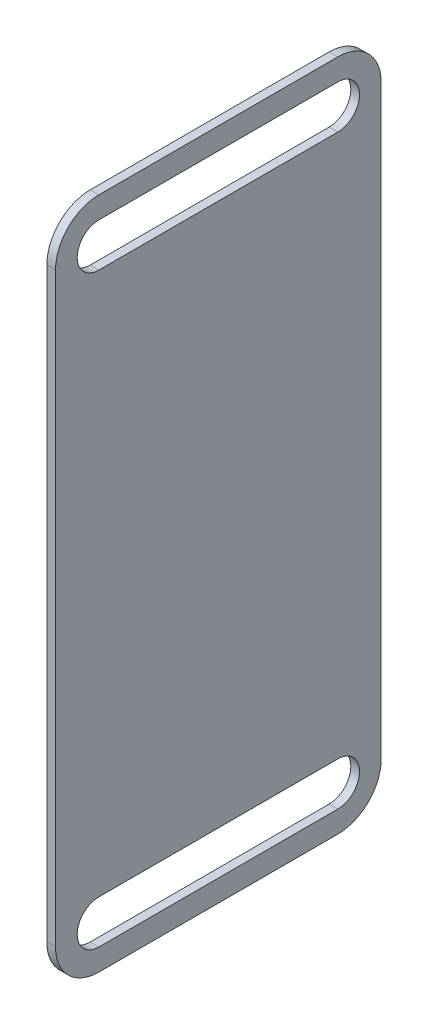
ISO-10303-21;
HEADER;
FILE_DESCRIPTION(('STEP AP214'),'2;1');
FILE_NAME('part.step','',(''),(''),'','','');
FILE_SCHEMA(('AUTOMOTIVE_DESIGN { 1 0 10303 214 1 1 1 1 }'));
ENDSEC;
DATA;
#1=APPLICATION_CONTEXT('core data for automotive mechanical design processes');
#2=APPLICATION_PROTOCOL_DEFINITION('international standard','automotive_design',2000,#1);
#3=PRODUCT_CONTEXT('',#1,'mechanical');
#4=PRODUCT('Part','Part','',(#3));
#5=PRODUCT_RELATED_PRODUCT_CATEGORY('part','',(#4));
#6=PRODUCT_DEFINITION_FORMATION('','',#4);
#7=PRODUCT_DEFINITION_CONTEXT('part definition',#1,'design');
#8=PRODUCT_DEFINITION('design','',#6,#7);
#9=PRODUCT_DEFINITION_SHAPE('','',#8);
#10=(LENGTH_UNIT() NAMED_UNIT(*) SI_UNIT(.MILLI.,.METRE.));
#11=(NAMED_UNIT(*) PLANE_ANGLE_UNIT() SI_UNIT($,.RADIAN.));
#12=(NAMED_UNIT(*) SI_UNIT($,.STERADIAN.) SOLID_ANGLE_UNIT());
#13=UNCERTAINTY_MEASURE_WITH_UNIT(LENGTH_MEASURE(1.E-05),#10,'distance_accuracy_value','');
#14=(GEOMETRIC_REPRESENTATION_CONTEXT(3) GLOBAL_UNCERTAINTY_ASSIGNED_CONTEXT((#13)) GLOBAL_UNIT_ASSIGNED_CONTEXT((#10,
#11,#12)) REPRESENTATION_CONTEXT('',''));
#15=CARTESIAN_POINT('',(0.,0.,0.));
#16=DIRECTION('',(0.,0.,1.));
#17=DIRECTION('',(1.,0.,0.));
#18=AXIS2_PLACEMENT_3D('',#15,#16,#17);
#19=CARTESIAN_POINT('',(2.54,12.7,-12.7));
#20=DIRECTION('',(-1.,0.,0.));
#21=DIRECTION('',(0.,0.,1.));
#22=AXIS2_PLACEMENT_3D('',#19,#20,#21);
#23=PLANE('',#22);
#24=CARTESIAN_POINT('',(2.54,12.7,-82.55));
#25=DIRECTION('',(1.,0.,0.));
#26=DIRECTION('',(0.,0.,-1.));
#27=AXIS2_PLACEMENT_3D('',#24,#25,#26);
#28=CIRCLE('',#27,6.35);
#29=CARTESIAN_POINT('',(2.54,6.35,-82.55));
#30=VERTEX_POINT('',#29);
#31=CARTESIAN_POINT('',(2.54,19.05,-82.55));
#32=VERTEX_POINT('',#31);
#33=EDGE_CURVE('E183',#30,#32,#28,.T.);
#34=ORIENTED_EDGE('',*,*,#33,.F.);
#35=DIRECTION('',(0.,0.,-1.));
#36=VECTOR('',#35,1.);
#37=CARTESIAN_POINT('',(2.54,6.35,-82.55));
#38=LINE('',#37,#36);
#39=CARTESIAN_POINT('',(2.54,6.34999999999999,-12.7));
#40=VERTEX_POINT('',#39);
#41=EDGE_CURVE('E191',#40,#30,#38,.T.);
#42=ORIENTED_EDGE('',*,*,#41,.F.);
#43=CARTESIAN_POINT('',(2.54,12.7,-12.7));
#44=DIRECTION('',(1.,0.,0.));
#45=DIRECTION('',(0.,0.,-1.));
#46=AXIS2_PLACEMENT_3D('',#43,#44,#45);
#47=CIRCLE('',#46,6.35);
#48=CARTESIAN_POINT('',(2.54,19.05,-12.7));
#49=VERTEX_POINT('',#48);
#50=EDGE_CURVE('E188',#49,#40,#47,.T.);
#51=ORIENTED_EDGE('',*,*,#50,.F.);
#52=DIRECTION('',(0.,0.,1.));
#53=VECTOR('',#52,1.);
#54=CARTESIAN_POINT('',(2.54,19.05,-82.55));
#55=LINE('',#54,#53);
#56=EDGE_CURVE('E185',#32,#49,#55,.T.);
#57=ORIENTED_EDGE('',*,*,#56,.F.);
#58=EDGE_LOOP('',(#34,#42,#51,#57));
#59=FACE_BOUND('',#58,.T.);
#60=CARTESIAN_POINT('',(2.54,12.7,-12.7));
#61=DIRECTION('',(1.,0.,0.));
#62=DIRECTION('',(0.,0.,1.));
#63=AXIS2_PLACEMENT_3D('',#60,#61,#62);
#64=CIRCLE('',#63,12.7);
#65=CARTESIAN_POINT('',(2.54,12.7000000000001,0.));
#66=VERTEX_POINT('',#65);
#67=CARTESIAN_POINT('',(2.54,0.,-12.7000000000001));
#68=VERTEX_POINT('',#67);
#69=EDGE_CURVE('E214',#66,#68,#64,.T.);
#70=ORIENTED_EDGE('',*,*,#69,.T.);
#71=DIRECTION('',(0.,0.,-1.));
#72=VECTOR('',#71,1.);
#73=CARTESIAN_POINT('',(2.54,0.,-12.7000000000001));
#74=LINE('',#73,#72);
#75=CARTESIAN_POINT('',(2.54,0.,-82.5499999999999));
#76=VERTEX_POINT('',#75);
#77=EDGE_CURVE('E217',#68,#76,#74,.T.);
#78=ORIENTED_EDGE('',*,*,#77,.T.);
#79=CARTESIAN_POINT('',(2.54,12.7,-82.55));
#80=DIRECTION('',(1.,0.,0.));
#81=DIRECTION('',(0.,0.,-1.));
#82=AXIS2_PLACEMENT_3D('',#79,#80,#81);
#83=CIRCLE('',#82,12.7);
#84=CARTESIAN_POINT('',(2.54,12.7,-95.25));
#85=VERTEX_POINT('',#84);
#86=EDGE_CURVE('E220',#76,#85,#83,.T.);
#87=ORIENTED_EDGE('',*,*,#86,.T.);
#88=DIRECTION('',(0.,1.,0.));
#89=VECTOR('',#88,1.);
#90=CARTESIAN_POINT('',(2.54,12.7000000000001,-95.25));
#91=LINE('',#90,#89);
#92=CARTESIAN_POINT('',(2.54,184.15,-95.25));
#93=VERTEX_POINT('',#92);
#94=EDGE_CURVE('E222',#85,#93,#91,.T.);
#95=ORIENTED_EDGE('',*,*,#94,.T.);
#96=CARTESIAN_POINT('',(2.54,184.15,-82.55));
#97=DIRECTION('',(1.,0.,0.));
#98=DIRECTION('',(0.,0.,1.));
#99=AXIS2_PLACEMENT_3D('',#96,#97,#98);
#100=CIRCLE('',#99,12.7);
#101=CARTESIAN_POINT('',(2.54,196.85,-82.5499999999999));
#102=VERTEX_POINT('',#101);
#103=EDGE_CURVE('E224',#93,#102,#100,.T.);
#104=ORIENTED_EDGE('',*,*,#103,.T.);
#105=DIRECTION('',(0.,0.,1.));
#106=VECTOR('',#105,1.);
#107=CARTESIAN_POINT('',(2.54,196.85,-12.7000000000001));
#108=LINE('',#107,#106);
#109=CARTESIAN_POINT('',(2.54,196.85,-12.7000000000001));
#110=VERTEX_POINT('',#109);
#111=EDGE_CURVE('E226',#102,#110,#108,.T.);
#112=ORIENTED_EDGE('',*,*,#111,.T.);
#113=CARTESIAN_POINT('',(2.54,184.15,-12.7));
#114=DIRECTION('',(1.,0.,0.));
#115=DIRECTION('',(0.,0.,1.));
#116=AXIS2_PLACEMENT_3D('',#113,#114,#115);
#117=CIRCLE('',#116,12.7);
#118=CARTESIAN_POINT('',(2.54,184.15,0.));
#119=VERTEX_POINT('',#118);
#120=EDGE_CURVE('E228',#110,#119,#117,.T.);
#121=ORIENTED_EDGE('',*,*,#120,.T.);
#122=DIRECTION('',(0.,-1.,0.));
#123=VECTOR('',#122,1.);
#124=CARTESIAN_POINT('',(2.54,12.7000000000001,0.));
#125=LINE('',#124,#123);
#126=EDGE_CURVE('E230',#119,#66,#125,.T.);
#127=ORIENTED_EDGE('',*,*,#126,.T.);
#128=EDGE_LOOP('',(#70,#78,#87,#95,#104,#112,#121,#127));
#129=FACE_BOUND('',#128,.T.);
#130=CARTESIAN_POINT('',(2.54,184.15,-82.55));
#131=DIRECTION('',(1.,0.,0.));
#132=DIRECTION('',(0.,0.,-1.));
#133=AXIS2_PLACEMENT_3D('',#130,#131,#132);
#134=CIRCLE('',#133,6.35000000000005);
#135=CARTESIAN_POINT('',(2.54,177.8,-82.55));
#136=VERTEX_POINT('',#135);
#137=CARTESIAN_POINT('',(2.54,190.5,-82.55));
#138=VERTEX_POINT('',#137);
#139=EDGE_CURVE('E147',#136,#138,#134,.T.);
#140=ORIENTED_EDGE('',*,*,#139,.F.);
#141=DIRECTION('',(0.,0.,-1.));
#142=VECTOR('',#141,1.);
#143=CARTESIAN_POINT('',(2.54,177.8,-82.55));
#144=LINE('',#143,#142);
#145=CARTESIAN_POINT('',(2.54,177.8,-12.7));
#146=VERTEX_POINT('',#145);
#147=EDGE_CURVE('E169',#146,#136,#144,.T.);
#148=ORIENTED_EDGE('',*,*,#147,.F.);
#149=CARTESIAN_POINT('',(2.54,184.15,-12.7));
#150=DIRECTION('',(1.,0.,0.));
#151=DIRECTION('',(0.,0.,-1.));
#152=AXIS2_PLACEMENT_3D('',#149,#150,#151);
#153=CIRCLE('',#152,6.35000000000001);
#154=CARTESIAN_POINT('',(2.54,190.5,-12.7));
#155=VERTEX_POINT('',#154);
#156=EDGE_CURVE('E167',#155,#146,#153,.T.);
#157=ORIENTED_EDGE('',*,*,#156,.F.);
#158=DIRECTION('',(0.,0.,1.));
#159=VECTOR('',#158,1.);
#160=CARTESIAN_POINT('',(2.54,190.5,-82.55));
#161=LINE('',#160,#159);
#162=EDGE_CURVE('E155',#138,#155,#161,.T.);
#163=ORIENTED_EDGE('',*,*,#162,.F.);
#164=EDGE_LOOP('',(#140,#148,#157,#163));
#165=FACE_BOUND('',#164,.T.);
#166=ADVANCED_FACE('F34',(#59,#129,#165),#23,.F.);
#167=CARTESIAN_POINT('',(0.,12.7,-12.7));
#168=DIRECTION('',(-1.,0.,0.));
#169=DIRECTION('',(0.,0.,1.));
#170=AXIS2_PLACEMENT_3D('',#167,#168,#169);
#171=PLANE('',#170);
#172=CARTESIAN_POINT('',(0.,12.7,-12.7));
#173=DIRECTION('',(1.,0.,0.));
#174=DIRECTION('',(0.,0.,1.));
#175=AXIS2_PLACEMENT_3D('',#172,#173,#174);
#176=CIRCLE('',#175,12.7);
#177=CARTESIAN_POINT('',(0.,12.7000000000001,0.));
#178=VERTEX_POINT('',#177);
#179=CARTESIAN_POINT('',(0.,0.,-12.7000000000001));
#180=VERTEX_POINT('',#179);
#181=EDGE_CURVE('E213',#178,#180,#176,.T.);
#182=ORIENTED_EDGE('',*,*,#181,.F.);
#183=DIRECTION('',(0.,-1.,0.));
#184=VECTOR('',#183,1.);
#185=CARTESIAN_POINT('',(0.,12.7000000000001,0.));
#186=LINE('',#185,#184);
#187=CARTESIAN_POINT('',(0.,184.15,0.));
#188=VERTEX_POINT('',#187);
#189=EDGE_CURVE('E218',#188,#178,#186,.T.);
#190=ORIENTED_EDGE('',*,*,#189,.F.);
#191=CARTESIAN_POINT('',(0.,184.15,-12.7));
#192=DIRECTION('',(1.,0.,0.));
#193=DIRECTION('',(0.,0.,1.));
#194=AXIS2_PLACEMENT_3D('',#191,#192,#193);
#195=CIRCLE('',#194,12.7);
#196=CARTESIAN_POINT('',(0.,196.85,-12.7000000000001));
#197=VERTEX_POINT('',#196);
#198=EDGE_CURVE('E245',#197,#188,#195,.T.);
#199=ORIENTED_EDGE('',*,*,#198,.F.);
#200=DIRECTION('',(0.,0.,1.));
#201=VECTOR('',#200,1.);
#202=CARTESIAN_POINT('',(0.,196.85,-12.7000000000001));
#203=LINE('',#202,#201);
#204=CARTESIAN_POINT('',(0.,196.85,-82.5499999999999));
#205=VERTEX_POINT('',#204);
#206=EDGE_CURVE('E243',#205,#197,#203,.T.);
#207=ORIENTED_EDGE('',*,*,#206,.F.);
#208=CARTESIAN_POINT('',(0.,184.15,-82.55));
#209=DIRECTION('',(1.,0.,0.));
#210=DIRECTION('',(0.,0.,1.));
#211=AXIS2_PLACEMENT_3D('',#208,#209,#210);
#212=CIRCLE('',#211,12.7);
#213=CARTESIAN_POINT('',(0.,184.15,-95.25));
#214=VERTEX_POINT('',#213);
#215=EDGE_CURVE('E241',#214,#205,#212,.T.);
#216=ORIENTED_EDGE('',*,*,#215,.F.);
#217=DIRECTION('',(0.,1.,0.));
#218=VECTOR('',#217,1.);
#219=CARTESIAN_POINT('',(0.,12.7000000000001,-95.25));
#220=LINE('',#219,#218);
#221=CARTESIAN_POINT('',(0.,12.7,-95.25));
#222=VERTEX_POINT('',#221);
#223=EDGE_CURVE('E239',#222,#214,#220,.T.);
#224=ORIENTED_EDGE('',*,*,#223,.F.);
#225=CARTESIAN_POINT('',(0.,12.7,-82.55));
#226=DIRECTION('',(1.,0.,0.));
#227=DIRECTION('',(0.,0.,-1.));
#228=AXIS2_PLACEMENT_3D('',#225,#226,#227);
#229=CIRCLE('',#228,12.7);
#230=CARTESIAN_POINT('',(0.,0.,-82.5499999999999));
#231=VERTEX_POINT('',#230);
#232=EDGE_CURVE('E237',#231,#222,#229,.T.);
#233=ORIENTED_EDGE('',*,*,#232,.F.);
#234=DIRECTION('',(0.,0.,-1.));
#235=VECTOR('',#234,1.);
#236=CARTESIAN_POINT('',(0.,0.,-12.7000000000001));
#237=LINE('',#236,#235);
#238=EDGE_CURVE('E235',#180,#231,#237,.T.);
#239=ORIENTED_EDGE('',*,*,#238,.F.);
#240=EDGE_LOOP('',(#182,#190,#199,#207,#216,#224,#233,#239));
#241=FACE_BOUND('',#240,.T.);
#242=DIRECTION('',(0.,0.,-1.));
#243=VECTOR('',#242,1.);
#244=CARTESIAN_POINT('',(0.,6.35,-82.55));
#245=LINE('',#244,#243);
#246=CARTESIAN_POINT('',(0.,6.34999999999999,-12.7));
#247=VERTEX_POINT('',#246);
#248=CARTESIAN_POINT('',(0.,6.35,-82.55));
#249=VERTEX_POINT('',#248);
#250=EDGE_CURVE('E186',#247,#249,#245,.T.);
#251=ORIENTED_EDGE('',*,*,#250,.T.);
#252=CARTESIAN_POINT('',(0.,12.7,-82.55));
#253=DIRECTION('',(1.,0.,0.));
#254=DIRECTION('',(0.,0.,-1.));
#255=AXIS2_PLACEMENT_3D('',#252,#253,#254);
#256=CIRCLE('',#255,6.35);
#257=CARTESIAN_POINT('',(0.,19.05,-82.55));
#258=VERTEX_POINT('',#257);
#259=EDGE_CURVE('E163',#249,#258,#256,.T.);
#260=ORIENTED_EDGE('',*,*,#259,.T.);
#261=DIRECTION('',(0.,0.,1.));
#262=VECTOR('',#261,1.);
#263=CARTESIAN_POINT('',(0.,19.05,-82.55));
#264=LINE('',#263,#262);
#265=CARTESIAN_POINT('',(0.,19.05,-12.7));
#266=VERTEX_POINT('',#265);
#267=EDGE_CURVE('E196',#258,#266,#264,.T.);
#268=ORIENTED_EDGE('',*,*,#267,.T.);
#269=CARTESIAN_POINT('',(0.,12.7,-12.7));
#270=DIRECTION('',(1.,0.,0.));
#271=DIRECTION('',(0.,0.,-1.));
#272=AXIS2_PLACEMENT_3D('',#269,#270,#271);
#273=CIRCLE('',#272,6.35);
#274=EDGE_CURVE('E199',#266,#247,#273,.T.);
#275=ORIENTED_EDGE('',*,*,#274,.T.);
#276=EDGE_LOOP('',(#251,#260,#268,#275));
#277=FACE_BOUND('',#276,.T.);
#278=DIRECTION('',(0.,0.,-1.));
#279=VECTOR('',#278,1.);
#280=CARTESIAN_POINT('',(0.,177.8,-82.55));
#281=LINE('',#280,#279);
#282=CARTESIAN_POINT('',(0.,177.8,-12.7));
#283=VERTEX_POINT('',#282);
#284=CARTESIAN_POINT('',(0.,177.8,-82.55));
#285=VERTEX_POINT('',#284);
#286=EDGE_CURVE('E156',#283,#285,#281,.T.);
#287=ORIENTED_EDGE('',*,*,#286,.T.);
#288=CARTESIAN_POINT('',(0.,184.15,-82.55));
#289=DIRECTION('',(1.,0.,0.));
#290=DIRECTION('',(0.,0.,-1.));
#291=AXIS2_PLACEMENT_3D('',#288,#289,#290);
#292=CIRCLE('',#291,6.35000000000005);
#293=CARTESIAN_POINT('',(0.,190.5,-82.55));
#294=VERTEX_POINT('',#293);
#295=EDGE_CURVE('E57',#285,#294,#292,.T.);
#296=ORIENTED_EDGE('',*,*,#295,.T.);
#297=DIRECTION('',(0.,0.,1.));
#298=VECTOR('',#297,1.);
#299=CARTESIAN_POINT('',(0.,190.5,-82.55));
#300=LINE('',#299,#298);
#301=CARTESIAN_POINT('',(0.,190.5,-12.7));
#302=VERTEX_POINT('',#301);
#303=EDGE_CURVE('E162',#294,#302,#300,.T.);
#304=ORIENTED_EDGE('',*,*,#303,.T.);
#305=CARTESIAN_POINT('',(0.,184.15,-12.7));
#306=DIRECTION('',(1.,0.,0.));
#307=DIRECTION('',(0.,0.,-1.));
#308=AXIS2_PLACEMENT_3D('',#305,#306,#307);
#309=CIRCLE('',#308,6.35000000000001);
#310=EDGE_CURVE('E175',#302,#283,#309,.T.);
#311=ORIENTED_EDGE('',*,*,#310,.T.);
#312=EDGE_LOOP('',(#287,#296,#304,#311));
#313=FACE_BOUND('',#312,.T.);
#314=ADVANCED_FACE('F275',(#241,#277,#313),#171,.T.);
#315=CARTESIAN_POINT('',(2.54,12.7,-12.7));
#316=DIRECTION('',(-1.,0.,0.));
#317=DIRECTION('',(0.,0.,1.));
#318=AXIS2_PLACEMENT_3D('',#315,#316,#317);
#319=CYLINDRICAL_SURFACE('',#318,12.7);
#320=ORIENTED_EDGE('',*,*,#181,.T.);
#321=DIRECTION('',(-1.,0.,0.));
#322=VECTOR('',#321,1.);
#323=CARTESIAN_POINT('',(2.54,0.,-12.7000000000001));
#324=LINE('',#323,#322);
#325=EDGE_CURVE('E11',#68,#180,#324,.T.);
#326=ORIENTED_EDGE('',*,*,#325,.F.);
#327=ORIENTED_EDGE('',*,*,#69,.F.);
#328=DIRECTION('',(-1.,0.,0.));
#329=VECTOR('',#328,1.);
#330=CARTESIAN_POINT('',(2.54,12.7000000000001,0.));
#331=LINE('',#330,#329);
#332=EDGE_CURVE('E232',#66,#178,#331,.T.);
#333=ORIENTED_EDGE('',*,*,#332,.T.);
#334=EDGE_LOOP('',(#320,#326,#327,#333));
#335=FACE_BOUND('',#334,.T.);
#336=ADVANCED_FACE('F36',(#335),#319,.T.);
#337=CARTESIAN_POINT('',(2.54,0.,-12.7000000000001));
#338=DIRECTION('',(0.,1.,0.));
#339=DIRECTION('',(0.,0.,1.));
#340=AXIS2_PLACEMENT_3D('',#337,#338,#339);
#341=PLANE('',#340);
#342=ORIENTED_EDGE('',*,*,#238,.T.);
#343=DIRECTION('',(-1.,0.,0.));
#344=VECTOR('',#343,1.);
#345=CARTESIAN_POINT('',(2.54,0.,-82.5499999999999));
#346=LINE('',#345,#344);
#347=EDGE_CURVE('E42',#76,#231,#346,.T.);
#348=ORIENTED_EDGE('',*,*,#347,.F.);
#349=ORIENTED_EDGE('',*,*,#77,.F.);
#350=ORIENTED_EDGE('',*,*,#325,.T.);
#351=EDGE_LOOP('',(#342,#348,#349,#350));
#352=FACE_BOUND('',#351,.T.);
#353=ADVANCED_FACE('F292',(#352),#341,.F.);
#354=CARTESIAN_POINT('',(2.54,12.7,-82.55));
#355=DIRECTION('',(-1.,0.,0.));
#356=DIRECTION('',(0.,0.,1.));
#357=AXIS2_PLACEMENT_3D('',#354,#355,#356);
#358=CYLINDRICAL_SURFACE('',#357,12.7);
#359=ORIENTED_EDGE('',*,*,#232,.T.);
#360=DIRECTION('',(-1.,0.,0.));
#361=VECTOR('',#360,1.);
#362=CARTESIAN_POINT('',(2.54,12.7,-95.25));
#363=LINE('',#362,#361);
#364=EDGE_CURVE('E262',#85,#222,#363,.T.);
#365=ORIENTED_EDGE('',*,*,#364,.F.);
#366=ORIENTED_EDGE('',*,*,#86,.F.);
#367=ORIENTED_EDGE('',*,*,#347,.T.);
#368=EDGE_LOOP('',(#359,#365,#366,#367));
#369=FACE_BOUND('',#368,.T.);
#370=ADVANCED_FACE('F269',(#369),#358,.T.);
#371=CARTESIAN_POINT('',(2.54,12.7000000000001,-95.25));
#372=DIRECTION('',(0.,0.,1.));
#373=DIRECTION('',(1.,0.,0.));
#374=AXIS2_PLACEMENT_3D('',#371,#372,#373);
#375=PLANE('',#374);
#376=ORIENTED_EDGE('',*,*,#223,.T.);
#377=DIRECTION('',(-1.,0.,0.));
#378=VECTOR('',#377,1.);
#379=CARTESIAN_POINT('',(2.54,184.15,-95.25));
#380=LINE('',#379,#378);
#381=EDGE_CURVE('E259',#93,#214,#380,.T.);
#382=ORIENTED_EDGE('',*,*,#381,.F.);
#383=ORIENTED_EDGE('',*,*,#94,.F.);
#384=ORIENTED_EDGE('',*,*,#364,.T.);
#385=EDGE_LOOP('',(#376,#382,#383,#384));
#386=FACE_BOUND('',#385,.T.);
#387=ADVANCED_FACE('F281',(#386),#375,.F.);
#388=CARTESIAN_POINT('',(2.54,184.15,-82.55));
#389=DIRECTION('',(-1.,0.,0.));
#390=DIRECTION('',(0.,0.,1.));
#391=AXIS2_PLACEMENT_3D('',#388,#389,#390);
#392=CYLINDRICAL_SURFACE('',#391,12.7);
#393=ORIENTED_EDGE('',*,*,#215,.T.);
#394=DIRECTION('',(-1.,0.,0.));
#395=VECTOR('',#394,1.);
#396=CARTESIAN_POINT('',(2.54,196.85,-82.5499999999999));
#397=LINE('',#396,#395);
#398=EDGE_CURVE('E256',#102,#205,#397,.T.);
#399=ORIENTED_EDGE('',*,*,#398,.F.);
#400=ORIENTED_EDGE('',*,*,#103,.F.);
#401=ORIENTED_EDGE('',*,*,#381,.T.);
#402=EDGE_LOOP('',(#393,#399,#400,#401));
#403=FACE_BOUND('',#402,.T.);
#404=ADVANCED_FACE('F285',(#403),#392,.T.);
#405=CARTESIAN_POINT('',(2.54,196.85,-12.7000000000001));
#406=DIRECTION('',(0.,-1.,0.));
#407=DIRECTION('',(0.,0.,-1.));
#408=AXIS2_PLACEMENT_3D('',#405,#406,#407);
#409=PLANE('',#408);
#410=ORIENTED_EDGE('',*,*,#206,.T.);
#411=DIRECTION('',(-1.,0.,0.));
#412=VECTOR('',#411,1.);
#413=CARTESIAN_POINT('',(2.54,196.85,-12.7000000000001));
#414=LINE('',#413,#412);
#415=EDGE_CURVE('E253',#110,#197,#414,.T.);
#416=ORIENTED_EDGE('',*,*,#415,.F.);
#417=ORIENTED_EDGE('',*,*,#111,.F.);
#418=ORIENTED_EDGE('',*,*,#398,.T.);
#419=EDGE_LOOP('',(#410,#416,#417,#418));
#420=FACE_BOUND('',#419,.T.);
#421=ADVANCED_FACE('F305',(#420),#409,.F.);
#422=CARTESIAN_POINT('',(2.54,184.15,-12.7));
#423=DIRECTION('',(-1.,0.,0.));
#424=DIRECTION('',(0.,0.,1.));
#425=AXIS2_PLACEMENT_3D('',#422,#423,#424);
#426=CYLINDRICAL_SURFACE('',#425,12.7);
#427=ORIENTED_EDGE('',*,*,#198,.T.);
#428=DIRECTION('',(-1.,0.,0.));
#429=VECTOR('',#428,1.);
#430=CARTESIAN_POINT('',(2.54,184.15,0.));
#431=LINE('',#430,#429);
#432=EDGE_CURVE('E250',#119,#188,#431,.T.);
#433=ORIENTED_EDGE('',*,*,#432,.F.);
#434=ORIENTED_EDGE('',*,*,#120,.F.);
#435=ORIENTED_EDGE('',*,*,#415,.T.);
#436=EDGE_LOOP('',(#427,#433,#434,#435));
#437=FACE_BOUND('',#436,.T.);
#438=ADVANCED_FACE('F303',(#437),#426,.T.);
#439=CARTESIAN_POINT('',(2.54,12.7000000000001,0.));
#440=DIRECTION('',(0.,0.,-1.));
#441=DIRECTION('',(-1.,0.,0.));
#442=AXIS2_PLACEMENT_3D('',#439,#440,#441);
#443=PLANE('',#442);
#444=ORIENTED_EDGE('',*,*,#189,.T.);
#445=ORIENTED_EDGE('',*,*,#332,.F.);
#446=ORIENTED_EDGE('',*,*,#126,.F.);
#447=ORIENTED_EDGE('',*,*,#432,.T.);
#448=EDGE_LOOP('',(#444,#445,#446,#447));
#449=FACE_BOUND('',#448,.T.);
#450=ADVANCED_FACE('F298',(#449),#443,.F.);
#451=CARTESIAN_POINT('',(2.54,12.7,-82.55));
#452=DIRECTION('',(-1.,0.,0.));
#453=DIRECTION('',(0.,0.,1.));
#454=AXIS2_PLACEMENT_3D('',#451,#452,#453);
#455=CYLINDRICAL_SURFACE('',#454,6.35);
#456=ORIENTED_EDGE('',*,*,#259,.F.);
#457=DIRECTION('',(-1.,0.,0.));
#458=VECTOR('',#457,1.);
#459=CARTESIAN_POINT('',(2.54,6.35,-82.55));
#460=LINE('',#459,#458);
#461=EDGE_CURVE('E193',#30,#249,#460,.T.);
#462=ORIENTED_EDGE('',*,*,#461,.F.);
#463=ORIENTED_EDGE('',*,*,#33,.T.);
#464=DIRECTION('',(-1.,0.,0.));
#465=VECTOR('',#464,1.);
#466=CARTESIAN_POINT('',(2.54,19.05,-82.55));
#467=LINE('',#466,#465);
#468=EDGE_CURVE('E210',#32,#258,#467,.T.);
#469=ORIENTED_EDGE('',*,*,#468,.T.);
#470=EDGE_LOOP('',(#456,#462,#463,#469));
#471=FACE_BOUND('',#470,.T.);
#472=ADVANCED_FACE('F323',(#471),#455,.F.);
#473=CARTESIAN_POINT('',(2.54,19.05,-82.55));
#474=DIRECTION('',(0.,-1.,0.));
#475=DIRECTION('',(0.,0.,-1.));
#476=AXIS2_PLACEMENT_3D('',#473,#474,#475);
#477=PLANE('',#476);
#478=ORIENTED_EDGE('',*,*,#267,.F.);
#479=ORIENTED_EDGE('',*,*,#468,.F.);
#480=ORIENTED_EDGE('',*,*,#56,.T.);
#481=DIRECTION('',(-1.,0.,0.));
#482=VECTOR('',#481,1.);
#483=CARTESIAN_POINT('',(2.54,19.05,-12.7));
#484=LINE('',#483,#482);
#485=EDGE_CURVE('E208',#49,#266,#484,.T.);
#486=ORIENTED_EDGE('',*,*,#485,.T.);
#487=EDGE_LOOP('',(#478,#479,#480,#486));
#488=FACE_BOUND('',#487,.T.);
#489=ADVANCED_FACE('F330',(#488),#477,.T.);
#490=CARTESIAN_POINT('',(2.54,12.7,-12.7));
#491=DIRECTION('',(-1.,0.,0.));
#492=DIRECTION('',(0.,0.,1.));
#493=AXIS2_PLACEMENT_3D('',#490,#491,#492);
#494=CYLINDRICAL_SURFACE('',#493,6.35);
#495=ORIENTED_EDGE('',*,*,#274,.F.);
#496=ORIENTED_EDGE('',*,*,#485,.F.);
#497=ORIENTED_EDGE('',*,*,#50,.T.);
#498=DIRECTION('',(-1.,0.,0.));
#499=VECTOR('',#498,1.);
#500=CARTESIAN_POINT('',(2.54,6.34999999999999,-12.7));
#501=LINE('',#500,#499);
#502=EDGE_CURVE('E206',#40,#247,#501,.T.);
#503=ORIENTED_EDGE('',*,*,#502,.T.);
#504=EDGE_LOOP('',(#495,#496,#497,#503));
#505=FACE_BOUND('',#504,.T.);
#506=ADVANCED_FACE('F335',(#505),#494,.F.);
#507=CARTESIAN_POINT('',(2.54,6.35,-82.55));
#508=DIRECTION('',(0.,1.,0.));
#509=DIRECTION('',(0.,0.,1.));
#510=AXIS2_PLACEMENT_3D('',#507,#508,#509);
#511=PLANE('',#510);
#512=ORIENTED_EDGE('',*,*,#250,.F.);
#513=ORIENTED_EDGE('',*,*,#502,.F.);
#514=ORIENTED_EDGE('',*,*,#41,.T.);
#515=ORIENTED_EDGE('',*,*,#461,.T.);
#516=EDGE_LOOP('',(#512,#513,#514,#515));
#517=FACE_BOUND('',#516,.T.);
#518=ADVANCED_FACE('F341',(#517),#511,.T.);
#519=CARTESIAN_POINT('',(2.54,184.15,-82.55));
#520=DIRECTION('',(-1.,0.,0.));
#521=DIRECTION('',(0.,0.,1.));
#522=AXIS2_PLACEMENT_3D('',#519,#520,#521);
#523=CYLINDRICAL_SURFACE('',#522,6.35000000000005);
#524=ORIENTED_EDGE('',*,*,#295,.F.);
#525=DIRECTION('',(-1.,0.,0.));
#526=VECTOR('',#525,1.);
#527=CARTESIAN_POINT('',(2.54,177.8,-82.55));
#528=LINE('',#527,#526);
#529=EDGE_CURVE('E151',#136,#285,#528,.T.);
#530=ORIENTED_EDGE('',*,*,#529,.F.);
#531=ORIENTED_EDGE('',*,*,#139,.T.);
#532=DIRECTION('',(-1.,0.,0.));
#533=VECTOR('',#532,1.);
#534=CARTESIAN_POINT('',(2.54,190.5,-82.55));
#535=LINE('',#534,#533);
#536=EDGE_CURVE('E150',#138,#294,#535,.T.);
#537=ORIENTED_EDGE('',*,*,#536,.T.);
#538=EDGE_LOOP('',(#524,#530,#531,#537));
#539=FACE_BOUND('',#538,.T.);
#540=ADVANCED_FACE('F149',(#539),#523,.F.);
#541=CARTESIAN_POINT('',(2.54,190.5,-82.55));
#542=DIRECTION('',(0.,-1.,0.));
#543=DIRECTION('',(0.,0.,-1.));
#544=AXIS2_PLACEMENT_3D('',#541,#542,#543);
#545=PLANE('',#544);
#546=ORIENTED_EDGE('',*,*,#303,.F.);
#547=ORIENTED_EDGE('',*,*,#536,.F.);
#548=ORIENTED_EDGE('',*,*,#162,.T.);
#549=DIRECTION('',(-1.,0.,0.));
#550=VECTOR('',#549,1.);
#551=CARTESIAN_POINT('',(2.54,190.5,-12.7));
#552=LINE('',#551,#550);
#553=EDGE_CURVE('E164',#155,#302,#552,.T.);
#554=ORIENTED_EDGE('',*,*,#553,.T.);
#555=EDGE_LOOP('',(#546,#547,#548,#554));
#556=FACE_BOUND('',#555,.T.);
#557=ADVANCED_FACE('F159',(#556),#545,.T.);
#558=CARTESIAN_POINT('',(2.54,184.15,-12.7));
#559=DIRECTION('',(-1.,0.,0.));
#560=DIRECTION('',(0.,0.,1.));
#561=AXIS2_PLACEMENT_3D('',#558,#559,#560);
#562=CYLINDRICAL_SURFACE('',#561,6.35000000000001);
#563=ORIENTED_EDGE('',*,*,#310,.F.);
#564=ORIENTED_EDGE('',*,*,#553,.F.);
#565=ORIENTED_EDGE('',*,*,#156,.T.);
#566=DIRECTION('',(-1.,0.,0.));
#567=VECTOR('',#566,1.);
#568=CARTESIAN_POINT('',(2.54,177.8,-12.7));
#569=LINE('',#568,#567);
#570=EDGE_CURVE('E49',#146,#283,#569,.T.);
#571=ORIENTED_EDGE('',*,*,#570,.T.);
#572=EDGE_LOOP('',(#563,#564,#565,#571));
#573=FACE_BOUND('',#572,.T.);
#574=ADVANCED_FACE('F360',(#573),#562,.F.);
#575=CARTESIAN_POINT('',(2.54,177.8,-82.55));
#576=DIRECTION('',(0.,1.,0.));
#577=DIRECTION('',(0.,0.,1.));
#578=AXIS2_PLACEMENT_3D('',#575,#576,#577);
#579=PLANE('',#578);
#580=ORIENTED_EDGE('',*,*,#286,.F.);
#581=ORIENTED_EDGE('',*,*,#570,.F.);
#582=ORIENTED_EDGE('',*,*,#147,.T.);
#583=ORIENTED_EDGE('',*,*,#529,.T.);
#584=EDGE_LOOP('',(#580,#581,#582,#583));
#585=FACE_BOUND('',#584,.T.);
#586=ADVANCED_FACE('F363',(#585),#579,.T.);
#587=CLOSED_SHELL('',(#166,#314,#336,#353,#370,#387,#404,#421,#438,#450,#472,#489,#506,#518,
#540,#557,#574,#586));
#588=MANIFOLD_SOLID_BREP('B2',#587);
#589=ADVANCED_BREP_SHAPE_REPRESENTATION('',(#18,#588),#14);
#590=SHAPE_DEFINITION_REPRESENTATION(#9,#589);
ENDSEC;
END-ISO-10303-21;
